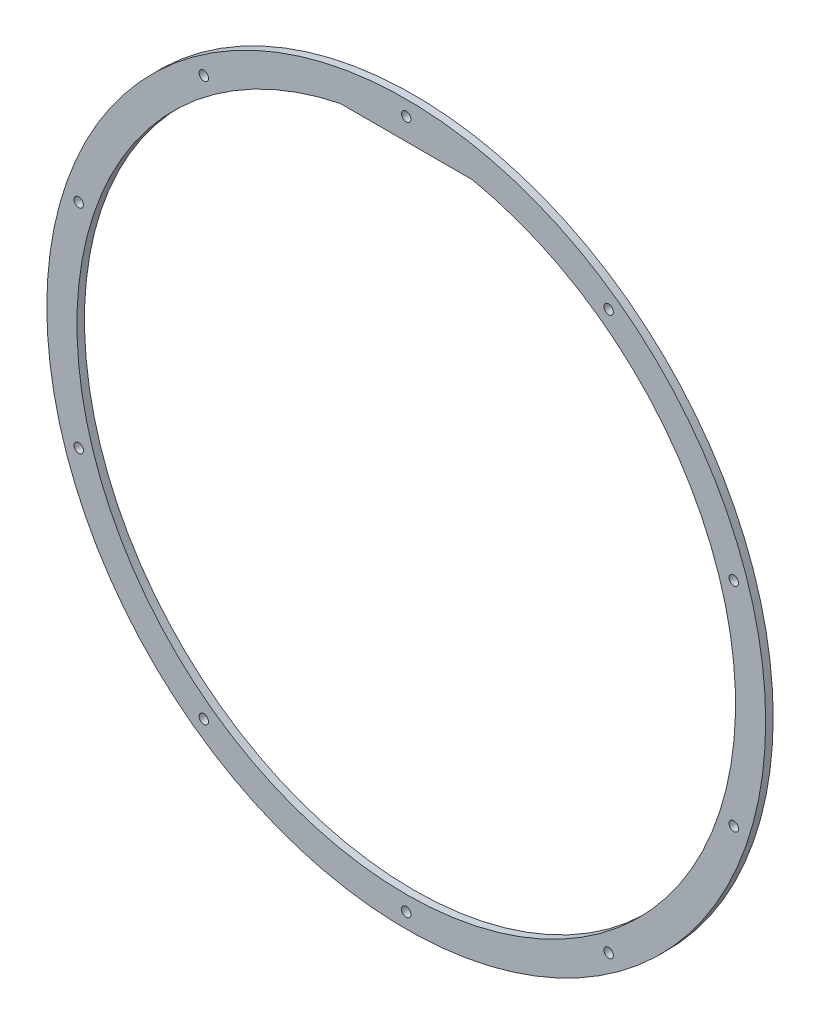
ISO-10303-21;
HEADER;
FILE_DESCRIPTION(('STEP AP214'),'2;1');
FILE_NAME('part.step','',(''),(''),'','','');
FILE_SCHEMA(('AUTOMOTIVE_DESIGN { 1 0 10303 214 1 1 1 1 }'));
ENDSEC;
DATA;
#1=APPLICATION_CONTEXT('core data for automotive mechanical design processes');
#2=APPLICATION_PROTOCOL_DEFINITION('international standard','automotive_design',2000,#1);
#3=PRODUCT_CONTEXT('',#1,'mechanical');
#4=PRODUCT('Part','Part','',(#3));
#5=PRODUCT_RELATED_PRODUCT_CATEGORY('part','',(#4));
#6=PRODUCT_DEFINITION_FORMATION('','',#4);
#7=PRODUCT_DEFINITION_CONTEXT('part definition',#1,'design');
#8=PRODUCT_DEFINITION('design','',#6,#7);
#9=PRODUCT_DEFINITION_SHAPE('','',#8);
#10=(LENGTH_UNIT() NAMED_UNIT(*) SI_UNIT(.MILLI.,.METRE.));
#11=(NAMED_UNIT(*) PLANE_ANGLE_UNIT() SI_UNIT($,.RADIAN.));
#12=(NAMED_UNIT(*) SI_UNIT($,.STERADIAN.) SOLID_ANGLE_UNIT());
#13=UNCERTAINTY_MEASURE_WITH_UNIT(LENGTH_MEASURE(1.E-05),#10,'distance_accuracy_value','');
#14=(GEOMETRIC_REPRESENTATION_CONTEXT(3) GLOBAL_UNCERTAINTY_ASSIGNED_CONTEXT((#13)) GLOBAL_UNIT_ASSIGNED_CONTEXT((#10,
#11,#12)) REPRESENTATION_CONTEXT('',''));
#15=CARTESIAN_POINT('',(0.,0.,0.));
#16=DIRECTION('',(0.,0.,1.));
#17=DIRECTION('',(1.,0.,0.));
#18=AXIS2_PLACEMENT_3D('',#15,#16,#17);
#19=CARTESIAN_POINT('',(0.,0.,4.));
#20=DIRECTION('',(0.,0.,1.));
#21=DIRECTION('',(1.,0.,0.));
#22=AXIS2_PLACEMENT_3D('',#19,#20,#21);
#23=PLANE('',#22);
#24=CARTESIAN_POINT('',(107.564701169521,148.050109970617,4.));
#25=DIRECTION('',(0.,0.,1.));
#26=DIRECTION('',(1.,0.,0.));
#27=AXIS2_PLACEMENT_3D('',#24,#25,#26);
#28=CIRCLE('',#27,2.5);
#29=CARTESIAN_POINT('',(110.064701169521,148.050109970617,4.));
#30=VERTEX_POINT('',#29);
#31=EDGE_CURVE('E137',#30,#30,#28,.T.);
#32=ORIENTED_EDGE('',*,*,#31,.F.);
#33=EDGE_LOOP('',(#32));
#34=FACE_BOUND('',#33,.T.);
#35=CARTESIAN_POINT('',(174.043342482012,56.5501099706174,4.));
#36=DIRECTION('',(0.,0.,1.));
#37=DIRECTION('',(1.,0.,0.));
#38=AXIS2_PLACEMENT_3D('',#35,#36,#37);
#39=CIRCLE('',#38,2.5);
#40=CARTESIAN_POINT('',(176.543342482012,56.5501099706174,4.));
#41=VERTEX_POINT('',#40);
#42=EDGE_CURVE('E131',#41,#41,#39,.T.);
#43=ORIENTED_EDGE('',*,*,#42,.F.);
#44=EDGE_LOOP('',(#43));
#45=FACE_BOUND('',#44,.T.);
#46=CARTESIAN_POINT('',(174.043342482014,-56.5501099706137,4.));
#47=DIRECTION('',(0.,0.,1.));
#48=DIRECTION('',(1.,0.,0.));
#49=AXIS2_PLACEMENT_3D('',#46,#47,#48);
#50=CIRCLE('',#49,2.5);
#51=CARTESIAN_POINT('',(176.543342482014,-56.5501099706137,4.));
#52=VERTEX_POINT('',#51);
#53=EDGE_CURVE('E125',#52,#52,#50,.T.);
#54=ORIENTED_EDGE('',*,*,#53,.F.);
#55=EDGE_LOOP('',(#54));
#56=FACE_BOUND('',#55,.T.);
#57=CARTESIAN_POINT('',(107.564701169524,-148.050109970614,4.));
#58=DIRECTION('',(0.,0.,1.));
#59=DIRECTION('',(1.,0.,0.));
#60=AXIS2_PLACEMENT_3D('',#57,#58,#59);
#61=CIRCLE('',#60,2.5);
#62=CARTESIAN_POINT('',(110.064701169524,-148.050109970614,4.));
#63=VERTEX_POINT('',#62);
#64=EDGE_CURVE('E119',#63,#63,#61,.T.);
#65=ORIENTED_EDGE('',*,*,#64,.F.);
#66=EDGE_LOOP('',(#65));
#67=FACE_BOUND('',#66,.T.);
#68=CARTESIAN_POINT('',(0.,-183.,4.));
#69=DIRECTION('',(0.,0.,1.));
#70=DIRECTION('',(1.,0.,0.));
#71=AXIS2_PLACEMENT_3D('',#68,#69,#70);
#72=CIRCLE('',#71,2.5);
#73=CARTESIAN_POINT('',(2.5,-183.,4.));
#74=VERTEX_POINT('',#73);
#75=EDGE_CURVE('E113',#74,#74,#72,.T.);
#76=ORIENTED_EDGE('',*,*,#75,.F.);
#77=EDGE_LOOP('',(#76));
#78=FACE_BOUND('',#77,.T.);
#79=CARTESIAN_POINT('',(-107.564701169522,-148.050109970616,4.));
#80=DIRECTION('',(0.,0.,1.));
#81=DIRECTION('',(1.,0.,0.));
#82=AXIS2_PLACEMENT_3D('',#79,#80,#81);
#83=CIRCLE('',#82,2.5);
#84=CARTESIAN_POINT('',(-105.064701169522,-148.050109970616,4.));
#85=VERTEX_POINT('',#84);
#86=EDGE_CURVE('E107',#85,#85,#83,.T.);
#87=ORIENTED_EDGE('',*,*,#86,.F.);
#88=EDGE_LOOP('',(#87));
#89=FACE_BOUND('',#88,.T.);
#90=CARTESIAN_POINT('',(-174.043342482013,-56.5501099706161,4.));
#91=DIRECTION('',(0.,0.,1.));
#92=DIRECTION('',(1.,0.,0.));
#93=AXIS2_PLACEMENT_3D('',#90,#91,#92);
#94=CIRCLE('',#93,2.5);
#95=CARTESIAN_POINT('',(-171.543342482013,-56.5501099706161,4.));
#96=VERTEX_POINT('',#95);
#97=EDGE_CURVE('E101',#96,#96,#94,.T.);
#98=ORIENTED_EDGE('',*,*,#97,.F.);
#99=EDGE_LOOP('',(#98));
#100=FACE_BOUND('',#99,.T.);
#101=CARTESIAN_POINT('',(-174.043342482013,56.5501099706149,4.));
#102=DIRECTION('',(0.,0.,1.));
#103=DIRECTION('',(1.,0.,0.));
#104=AXIS2_PLACEMENT_3D('',#101,#102,#103);
#105=CIRCLE('',#104,2.5);
#106=CARTESIAN_POINT('',(-171.543342482013,56.5501099706149,4.));
#107=VERTEX_POINT('',#106);
#108=EDGE_CURVE('E95',#107,#107,#105,.T.);
#109=ORIENTED_EDGE('',*,*,#108,.F.);
#110=EDGE_LOOP('',(#109));
#111=FACE_BOUND('',#110,.T.);
#112=CARTESIAN_POINT('',(-107.564701169523,148.050109970615,4.));
#113=DIRECTION('',(0.,0.,1.));
#114=DIRECTION('',(1.,0.,0.));
#115=AXIS2_PLACEMENT_3D('',#112,#113,#114);
#116=CIRCLE('',#115,2.5);
#117=CARTESIAN_POINT('',(-105.064701169523,148.050109970615,4.));
#118=VERTEX_POINT('',#117);
#119=EDGE_CURVE('E89',#118,#118,#116,.T.);
#120=ORIENTED_EDGE('',*,*,#119,.F.);
#121=EDGE_LOOP('',(#120));
#122=FACE_BOUND('',#121,.T.);
#123=CARTESIAN_POINT('',(0.,183.,4.));
#124=DIRECTION('',(0.,0.,1.));
#125=DIRECTION('',(1.,0.,0.));
#126=AXIS2_PLACEMENT_3D('',#123,#124,#125);
#127=CIRCLE('',#126,2.5);
#128=CARTESIAN_POINT('',(2.5,183.,4.));
#129=VERTEX_POINT('',#128);
#130=EDGE_CURVE('E77',#129,#129,#127,.T.);
#131=ORIENTED_EDGE('',*,*,#130,.F.);
#132=EDGE_LOOP('',(#131));
#133=FACE_BOUND('',#132,.T.);
#134=CARTESIAN_POINT('',(0.,0.,4.));
#135=DIRECTION('',(0.,0.,1.));
#136=DIRECTION('',(1.,0.,0.));
#137=AXIS2_PLACEMENT_3D('',#134,#135,#136);
#138=CIRCLE('',#137,191.);
#139=CARTESIAN_POINT('',(191.,0.,4.));
#140=VERTEX_POINT('',#139);
#141=EDGE_CURVE('E11',#140,#140,#138,.T.);
#142=ORIENTED_EDGE('',*,*,#141,.T.);
#143=EDGE_LOOP('',(#142));
#144=FACE_BOUND('',#143,.T.);
#145=DIRECTION('',(-1.,0.,0.));
#146=VECTOR('',#145,1.);
#147=CARTESIAN_POINT('',(-35.,171.464281994823,4.));
#148=LINE('',#147,#146);
#149=CARTESIAN_POINT('',(35.,171.464281994823,4.));
#150=VERTEX_POINT('',#149);
#151=CARTESIAN_POINT('',(-35.,171.464281994823,4.));
#152=VERTEX_POINT('',#151);
#153=EDGE_CURVE('E80',#150,#152,#148,.T.);
#154=ORIENTED_EDGE('',*,*,#153,.F.);
#155=CARTESIAN_POINT('',(0.,0.,4.));
#156=DIRECTION('',(0.,0.,1.));
#157=DIRECTION('',(1.,0.,0.));
#158=AXIS2_PLACEMENT_3D('',#155,#156,#157);
#159=CIRCLE('',#158,175.);
#160=EDGE_CURVE('E67',#152,#150,#159,.T.);
#161=ORIENTED_EDGE('',*,*,#160,.F.);
#162=EDGE_LOOP('',(#154,#161));
#163=FACE_BOUND('',#162,.T.);
#164=ADVANCED_FACE('F35',(#34,#45,#56,#67,#78,#89,#100,#111,#122,#133,#144,#163),#23,.T.);
#165=CARTESIAN_POINT('',(0.,0.,0.));
#166=DIRECTION('',(0.,0.,1.));
#167=DIRECTION('',(1.,0.,0.));
#168=AXIS2_PLACEMENT_3D('',#165,#166,#167);
#169=PLANE('',#168);
#170=CARTESIAN_POINT('',(107.564701169521,148.050109970617,0.));
#171=DIRECTION('',(0.,0.,1.));
#172=DIRECTION('',(1.,0.,0.));
#173=AXIS2_PLACEMENT_3D('',#170,#171,#172);
#174=CIRCLE('',#173,2.5);
#175=CARTESIAN_POINT('',(110.064701169521,148.050109970617,0.));
#176=VERTEX_POINT('',#175);
#177=EDGE_CURVE('E134',#176,#176,#174,.T.);
#178=ORIENTED_EDGE('',*,*,#177,.T.);
#179=EDGE_LOOP('',(#178));
#180=FACE_BOUND('',#179,.T.);
#181=CARTESIAN_POINT('',(174.043342482012,56.5501099706174,0.));
#182=DIRECTION('',(0.,0.,1.));
#183=DIRECTION('',(1.,0.,0.));
#184=AXIS2_PLACEMENT_3D('',#181,#182,#183);
#185=CIRCLE('',#184,2.5);
#186=CARTESIAN_POINT('',(176.543342482012,56.5501099706174,0.));
#187=VERTEX_POINT('',#186);
#188=EDGE_CURVE('E128',#187,#187,#185,.T.);
#189=ORIENTED_EDGE('',*,*,#188,.T.);
#190=EDGE_LOOP('',(#189));
#191=FACE_BOUND('',#190,.T.);
#192=CARTESIAN_POINT('',(174.043342482014,-56.5501099706137,0.));
#193=DIRECTION('',(0.,0.,1.));
#194=DIRECTION('',(1.,0.,0.));
#195=AXIS2_PLACEMENT_3D('',#192,#193,#194);
#196=CIRCLE('',#195,2.5);
#197=CARTESIAN_POINT('',(176.543342482014,-56.5501099706137,0.));
#198=VERTEX_POINT('',#197);
#199=EDGE_CURVE('E122',#198,#198,#196,.T.);
#200=ORIENTED_EDGE('',*,*,#199,.T.);
#201=EDGE_LOOP('',(#200));
#202=FACE_BOUND('',#201,.T.);
#203=CARTESIAN_POINT('',(107.564701169524,-148.050109970614,0.));
#204=DIRECTION('',(0.,0.,1.));
#205=DIRECTION('',(1.,0.,0.));
#206=AXIS2_PLACEMENT_3D('',#203,#204,#205);
#207=CIRCLE('',#206,2.5);
#208=CARTESIAN_POINT('',(110.064701169524,-148.050109970614,0.));
#209=VERTEX_POINT('',#208);
#210=EDGE_CURVE('E116',#209,#209,#207,.T.);
#211=ORIENTED_EDGE('',*,*,#210,.T.);
#212=EDGE_LOOP('',(#211));
#213=FACE_BOUND('',#212,.T.);
#214=CARTESIAN_POINT('',(0.,-183.,0.));
#215=DIRECTION('',(0.,0.,1.));
#216=DIRECTION('',(1.,0.,0.));
#217=AXIS2_PLACEMENT_3D('',#214,#215,#216);
#218=CIRCLE('',#217,2.5);
#219=CARTESIAN_POINT('',(2.5,-183.,0.));
#220=VERTEX_POINT('',#219);
#221=EDGE_CURVE('E110',#220,#220,#218,.T.);
#222=ORIENTED_EDGE('',*,*,#221,.T.);
#223=EDGE_LOOP('',(#222));
#224=FACE_BOUND('',#223,.T.);
#225=CARTESIAN_POINT('',(-107.564701169522,-148.050109970616,0.));
#226=DIRECTION('',(0.,0.,1.));
#227=DIRECTION('',(1.,0.,0.));
#228=AXIS2_PLACEMENT_3D('',#225,#226,#227);
#229=CIRCLE('',#228,2.5);
#230=CARTESIAN_POINT('',(-105.064701169522,-148.050109970616,0.));
#231=VERTEX_POINT('',#230);
#232=EDGE_CURVE('E104',#231,#231,#229,.T.);
#233=ORIENTED_EDGE('',*,*,#232,.T.);
#234=EDGE_LOOP('',(#233));
#235=FACE_BOUND('',#234,.T.);
#236=CARTESIAN_POINT('',(-174.043342482013,-56.5501099706161,0.));
#237=DIRECTION('',(0.,0.,1.));
#238=DIRECTION('',(1.,0.,0.));
#239=AXIS2_PLACEMENT_3D('',#236,#237,#238);
#240=CIRCLE('',#239,2.5);
#241=CARTESIAN_POINT('',(-171.543342482013,-56.5501099706161,0.));
#242=VERTEX_POINT('',#241);
#243=EDGE_CURVE('E98',#242,#242,#240,.T.);
#244=ORIENTED_EDGE('',*,*,#243,.T.);
#245=EDGE_LOOP('',(#244));
#246=FACE_BOUND('',#245,.T.);
#247=CARTESIAN_POINT('',(-174.043342482013,56.5501099706149,0.));
#248=DIRECTION('',(0.,0.,1.));
#249=DIRECTION('',(1.,0.,0.));
#250=AXIS2_PLACEMENT_3D('',#247,#248,#249);
#251=CIRCLE('',#250,2.5);
#252=CARTESIAN_POINT('',(-171.543342482013,56.5501099706149,0.));
#253=VERTEX_POINT('',#252);
#254=EDGE_CURVE('E92',#253,#253,#251,.T.);
#255=ORIENTED_EDGE('',*,*,#254,.T.);
#256=EDGE_LOOP('',(#255));
#257=FACE_BOUND('',#256,.T.);
#258=CARTESIAN_POINT('',(-107.564701169523,148.050109970615,0.));
#259=DIRECTION('',(0.,0.,1.));
#260=DIRECTION('',(1.,0.,0.));
#261=AXIS2_PLACEMENT_3D('',#258,#259,#260);
#262=CIRCLE('',#261,2.5);
#263=CARTESIAN_POINT('',(-105.064701169523,148.050109970615,0.));
#264=VERTEX_POINT('',#263);
#265=EDGE_CURVE('E86',#264,#264,#262,.T.);
#266=ORIENTED_EDGE('',*,*,#265,.T.);
#267=EDGE_LOOP('',(#266));
#268=FACE_BOUND('',#267,.T.);
#269=CARTESIAN_POINT('',(0.,183.,0.));
#270=DIRECTION('',(0.,0.,1.));
#271=DIRECTION('',(1.,0.,0.));
#272=AXIS2_PLACEMENT_3D('',#269,#270,#271);
#273=CIRCLE('',#272,2.5);
#274=CARTESIAN_POINT('',(2.5,183.,0.));
#275=VERTEX_POINT('',#274);
#276=EDGE_CURVE('E74',#275,#275,#273,.T.);
#277=ORIENTED_EDGE('',*,*,#276,.T.);
#278=EDGE_LOOP('',(#277));
#279=FACE_BOUND('',#278,.T.);
#280=CARTESIAN_POINT('',(0.,0.,0.));
#281=DIRECTION('',(0.,0.,1.));
#282=DIRECTION('',(1.,0.,0.));
#283=AXIS2_PLACEMENT_3D('',#280,#281,#282);
#284=CIRCLE('',#283,191.);
#285=CARTESIAN_POINT('',(191.,0.,0.));
#286=VERTEX_POINT('',#285);
#287=EDGE_CURVE('E39',#286,#286,#284,.T.);
#288=ORIENTED_EDGE('',*,*,#287,.F.);
#289=EDGE_LOOP('',(#288));
#290=FACE_BOUND('',#289,.T.);
#291=CARTESIAN_POINT('',(0.,0.,0.));
#292=DIRECTION('',(0.,0.,1.));
#293=DIRECTION('',(1.,0.,0.));
#294=AXIS2_PLACEMENT_3D('',#291,#292,#293);
#295=CIRCLE('',#294,175.);
#296=CARTESIAN_POINT('',(-35.,171.464281994823,0.));
#297=VERTEX_POINT('',#296);
#298=CARTESIAN_POINT('',(35.,171.464281994823,0.));
#299=VERTEX_POINT('',#298);
#300=EDGE_CURVE('E57',#297,#299,#295,.T.);
#301=ORIENTED_EDGE('',*,*,#300,.T.);
#302=DIRECTION('',(-1.,0.,0.));
#303=VECTOR('',#302,1.);
#304=CARTESIAN_POINT('',(-35.,171.464281994823,0.));
#305=LINE('',#304,#303);
#306=EDGE_CURVE('E63',#299,#297,#305,.T.);
#307=ORIENTED_EDGE('',*,*,#306,.T.);
#308=EDGE_LOOP('',(#301,#307));
#309=FACE_BOUND('',#308,.T.);
#310=ADVANCED_FACE('F73',(#180,#191,#202,#213,#224,#235,#246,#257,#268,#279,#290,#309),#169,.F.);
#311=CARTESIAN_POINT('',(0.,0.,4.));
#312=DIRECTION('',(0.,0.,-1.));
#313=DIRECTION('',(-1.,0.,0.));
#314=AXIS2_PLACEMENT_3D('',#311,#312,#313);
#315=CYLINDRICAL_SURFACE('',#314,191.);
#316=ORIENTED_EDGE('',*,*,#141,.F.);
#317=EDGE_LOOP('',(#316));
#318=FACE_BOUND('',#317,.T.);
#319=ORIENTED_EDGE('',*,*,#287,.T.);
#320=EDGE_LOOP('',(#319));
#321=FACE_BOUND('',#320,.T.);
#322=ADVANCED_FACE('F37',(#318,#321),#315,.T.);
#323=CARTESIAN_POINT('',(0.,0.,4.));
#324=DIRECTION('',(0.,0.,-1.));
#325=DIRECTION('',(-1.,0.,0.));
#326=AXIS2_PLACEMENT_3D('',#323,#324,#325);
#327=CYLINDRICAL_SURFACE('',#326,175.);
#328=ORIENTED_EDGE('',*,*,#300,.F.);
#329=DIRECTION('',(0.,0.,-1.));
#330=VECTOR('',#329,1.);
#331=CARTESIAN_POINT('',(-35.,171.464281994823,4.));
#332=LINE('',#331,#330);
#333=EDGE_CURVE('E65',#152,#297,#332,.T.);
#334=ORIENTED_EDGE('',*,*,#333,.F.);
#335=ORIENTED_EDGE('',*,*,#160,.T.);
#336=DIRECTION('',(0.,0.,-1.));
#337=VECTOR('',#336,1.);
#338=CARTESIAN_POINT('',(35.,171.464281994823,4.));
#339=LINE('',#338,#337);
#340=EDGE_CURVE('E50',#150,#299,#339,.T.);
#341=ORIENTED_EDGE('',*,*,#340,.T.);
#342=EDGE_LOOP('',(#328,#334,#335,#341));
#343=FACE_BOUND('',#342,.T.);
#344=ADVANCED_FACE('F69',(#343),#327,.F.);
#345=CARTESIAN_POINT('',(-35.,171.464281994823,4.));
#346=DIRECTION('',(0.,-1.,0.));
#347=DIRECTION('',(0.,0.,-1.));
#348=AXIS2_PLACEMENT_3D('',#345,#346,#347);
#349=PLANE('',#348);
#350=ORIENTED_EDGE('',*,*,#306,.F.);
#351=ORIENTED_EDGE('',*,*,#340,.F.);
#352=ORIENTED_EDGE('',*,*,#153,.T.);
#353=ORIENTED_EDGE('',*,*,#333,.T.);
#354=EDGE_LOOP('',(#350,#351,#352,#353));
#355=FACE_BOUND('',#354,.T.);
#356=ADVANCED_FACE('F64',(#355),#349,.T.);
#357=CARTESIAN_POINT('',(0.,183.,4.));
#358=DIRECTION('',(0.,0.,1.));
#359=DIRECTION('',(1.,0.,0.));
#360=AXIS2_PLACEMENT_3D('',#357,#358,#359);
#361=CYLINDRICAL_SURFACE('',#360,2.5);
#362=ORIENTED_EDGE('',*,*,#276,.F.);
#363=EDGE_LOOP('',(#362));
#364=FACE_BOUND('',#363,.T.);
#365=ORIENTED_EDGE('',*,*,#130,.T.);
#366=EDGE_LOOP('',(#365));
#367=FACE_BOUND('',#366,.T.);
#368=ADVANCED_FACE('F182',(#364,#367),#361,.F.);
#369=CARTESIAN_POINT('',(-107.564701169523,148.050109970615,4.));
#370=DIRECTION('',(0.,0.,1.));
#371=DIRECTION('',(1.,0.,0.));
#372=AXIS2_PLACEMENT_3D('',#369,#370,#371);
#373=CYLINDRICAL_SURFACE('',#372,2.5);
#374=ORIENTED_EDGE('',*,*,#265,.F.);
#375=EDGE_LOOP('',(#374));
#376=FACE_BOUND('',#375,.T.);
#377=ORIENTED_EDGE('',*,*,#119,.T.);
#378=EDGE_LOOP('',(#377));
#379=FACE_BOUND('',#378,.T.);
#380=ADVANCED_FACE('F185',(#376,#379),#373,.F.);
#381=CARTESIAN_POINT('',(-174.043342482013,56.5501099706149,4.));
#382=DIRECTION('',(0.,0.,1.));
#383=DIRECTION('',(1.,0.,0.));
#384=AXIS2_PLACEMENT_3D('',#381,#382,#383);
#385=CYLINDRICAL_SURFACE('',#384,2.5);
#386=ORIENTED_EDGE('',*,*,#254,.F.);
#387=EDGE_LOOP('',(#386));
#388=FACE_BOUND('',#387,.T.);
#389=ORIENTED_EDGE('',*,*,#108,.T.);
#390=EDGE_LOOP('',(#389));
#391=FACE_BOUND('',#390,.T.);
#392=ADVANCED_FACE('F189',(#388,#391),#385,.F.);
#393=CARTESIAN_POINT('',(-174.043342482013,-56.5501099706161,4.));
#394=DIRECTION('',(0.,0.,1.));
#395=DIRECTION('',(1.,0.,0.));
#396=AXIS2_PLACEMENT_3D('',#393,#394,#395);
#397=CYLINDRICAL_SURFACE('',#396,2.5);
#398=ORIENTED_EDGE('',*,*,#243,.F.);
#399=EDGE_LOOP('',(#398));
#400=FACE_BOUND('',#399,.T.);
#401=ORIENTED_EDGE('',*,*,#97,.T.);
#402=EDGE_LOOP('',(#401));
#403=FACE_BOUND('',#402,.T.);
#404=ADVANCED_FACE('F193',(#400,#403),#397,.F.);
#405=CARTESIAN_POINT('',(-107.564701169522,-148.050109970616,4.));
#406=DIRECTION('',(0.,0.,1.));
#407=DIRECTION('',(1.,0.,0.));
#408=AXIS2_PLACEMENT_3D('',#405,#406,#407);
#409=CYLINDRICAL_SURFACE('',#408,2.5);
#410=ORIENTED_EDGE('',*,*,#232,.F.);
#411=EDGE_LOOP('',(#410));
#412=FACE_BOUND('',#411,.T.);
#413=ORIENTED_EDGE('',*,*,#86,.T.);
#414=EDGE_LOOP('',(#413));
#415=FACE_BOUND('',#414,.T.);
#416=ADVANCED_FACE('F197',(#412,#415),#409,.F.);
#417=CARTESIAN_POINT('',(0.,-183.,4.));
#418=DIRECTION('',(0.,0.,1.));
#419=DIRECTION('',(1.,0.,0.));
#420=AXIS2_PLACEMENT_3D('',#417,#418,#419);
#421=CYLINDRICAL_SURFACE('',#420,2.5);
#422=ORIENTED_EDGE('',*,*,#221,.F.);
#423=EDGE_LOOP('',(#422));
#424=FACE_BOUND('',#423,.T.);
#425=ORIENTED_EDGE('',*,*,#75,.T.);
#426=EDGE_LOOP('',(#425));
#427=FACE_BOUND('',#426,.T.);
#428=ADVANCED_FACE('F201',(#424,#427),#421,.F.);
#429=CARTESIAN_POINT('',(107.564701169524,-148.050109970614,4.));
#430=DIRECTION('',(0.,0.,1.));
#431=DIRECTION('',(1.,0.,0.));
#432=AXIS2_PLACEMENT_3D('',#429,#430,#431);
#433=CYLINDRICAL_SURFACE('',#432,2.5);
#434=ORIENTED_EDGE('',*,*,#210,.F.);
#435=EDGE_LOOP('',(#434));
#436=FACE_BOUND('',#435,.T.);
#437=ORIENTED_EDGE('',*,*,#64,.T.);
#438=EDGE_LOOP('',(#437));
#439=FACE_BOUND('',#438,.T.);
#440=ADVANCED_FACE('F205',(#436,#439),#433,.F.);
#441=CARTESIAN_POINT('',(174.043342482014,-56.5501099706137,4.));
#442=DIRECTION('',(0.,0.,1.));
#443=DIRECTION('',(1.,0.,0.));
#444=AXIS2_PLACEMENT_3D('',#441,#442,#443);
#445=CYLINDRICAL_SURFACE('',#444,2.5);
#446=ORIENTED_EDGE('',*,*,#199,.F.);
#447=EDGE_LOOP('',(#446));
#448=FACE_BOUND('',#447,.T.);
#449=ORIENTED_EDGE('',*,*,#53,.T.);
#450=EDGE_LOOP('',(#449));
#451=FACE_BOUND('',#450,.T.);
#452=ADVANCED_FACE('F209',(#448,#451),#445,.F.);
#453=CARTESIAN_POINT('',(174.043342482012,56.5501099706174,4.));
#454=DIRECTION('',(0.,0.,1.));
#455=DIRECTION('',(1.,0.,0.));
#456=AXIS2_PLACEMENT_3D('',#453,#454,#455);
#457=CYLINDRICAL_SURFACE('',#456,2.5);
#458=ORIENTED_EDGE('',*,*,#188,.F.);
#459=EDGE_LOOP('',(#458));
#460=FACE_BOUND('',#459,.T.);
#461=ORIENTED_EDGE('',*,*,#42,.T.);
#462=EDGE_LOOP('',(#461));
#463=FACE_BOUND('',#462,.T.);
#464=ADVANCED_FACE('F213',(#460,#463),#457,.F.);
#465=CARTESIAN_POINT('',(107.564701169521,148.050109970617,4.));
#466=DIRECTION('',(0.,0.,1.));
#467=DIRECTION('',(1.,0.,0.));
#468=AXIS2_PLACEMENT_3D('',#465,#466,#467);
#469=CYLINDRICAL_SURFACE('',#468,2.5);
#470=ORIENTED_EDGE('',*,*,#177,.F.);
#471=EDGE_LOOP('',(#470));
#472=FACE_BOUND('',#471,.T.);
#473=ORIENTED_EDGE('',*,*,#31,.T.);
#474=EDGE_LOOP('',(#473));
#475=FACE_BOUND('',#474,.T.);
#476=ADVANCED_FACE('F141',(#472,#475),#469,.F.);
#477=CLOSED_SHELL('',(#164,#310,#322,#344,#356,#368,#380,#392,#404,#416,#428,#440,#452,#464,#476));
#478=MANIFOLD_SOLID_BREP('B2',#477);
#479=ADVANCED_BREP_SHAPE_REPRESENTATION('',(#18,#478),#14);
#480=SHAPE_DEFINITION_REPRESENTATION(#9,#479);
ENDSEC;
END-ISO-10303-21;
